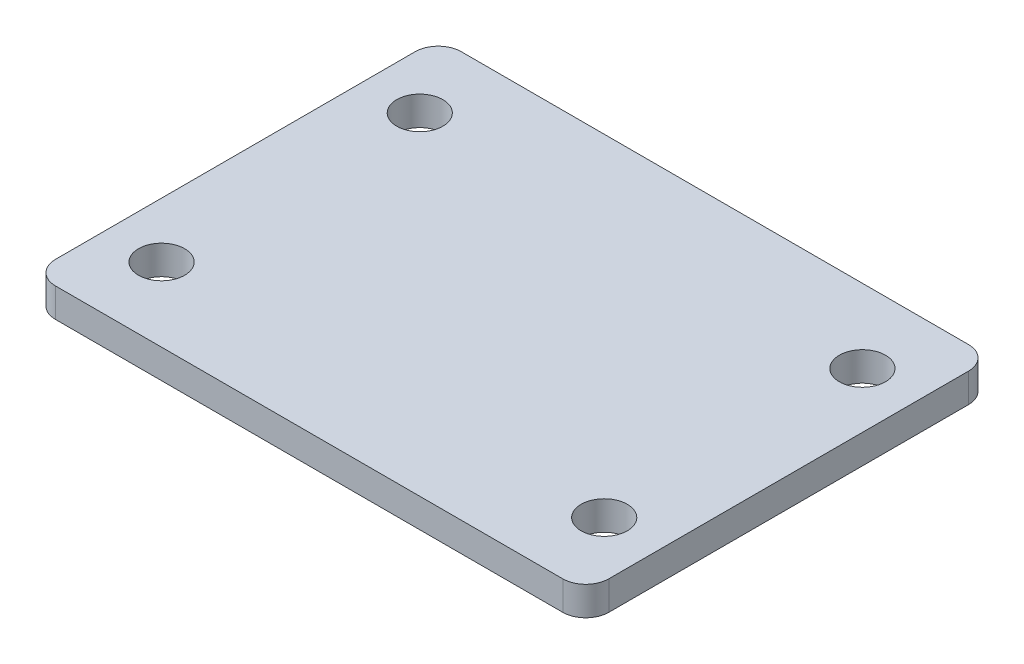
ISO-10303-21;
HEADER;
FILE_DESCRIPTION(('STEP AP214'),'2;1');
FILE_NAME('part.step','',(''),(''),'','','');
FILE_SCHEMA(('AUTOMOTIVE_DESIGN { 1 0 10303 214 1 1 1 1 }'));
ENDSEC;
DATA;
#1=APPLICATION_CONTEXT('core data for automotive mechanical design processes');
#2=APPLICATION_PROTOCOL_DEFINITION('international standard','automotive_design',2000,#1);
#3=PRODUCT_CONTEXT('',#1,'mechanical');
#4=PRODUCT('Part','Part','',(#3));
#5=PRODUCT_RELATED_PRODUCT_CATEGORY('part','',(#4));
#6=PRODUCT_DEFINITION_FORMATION('','',#4);
#7=PRODUCT_DEFINITION_CONTEXT('part definition',#1,'design');
#8=PRODUCT_DEFINITION('design','',#6,#7);
#9=PRODUCT_DEFINITION_SHAPE('','',#8);
#10=(LENGTH_UNIT() NAMED_UNIT(*) SI_UNIT(.MILLI.,.METRE.));
#11=(NAMED_UNIT(*) PLANE_ANGLE_UNIT() SI_UNIT($,.RADIAN.));
#12=(NAMED_UNIT(*) SI_UNIT($,.STERADIAN.) SOLID_ANGLE_UNIT());
#13=UNCERTAINTY_MEASURE_WITH_UNIT(LENGTH_MEASURE(1.E-05),#10,'distance_accuracy_value','');
#14=(GEOMETRIC_REPRESENTATION_CONTEXT(3) GLOBAL_UNCERTAINTY_ASSIGNED_CONTEXT((#13)) GLOBAL_UNIT_ASSIGNED_CONTEXT((#10,
#11,#12)) REPRESENTATION_CONTEXT('',''));
#15=CARTESIAN_POINT('',(0.,0.,0.));
#16=DIRECTION('',(0.,0.,1.));
#17=DIRECTION('',(1.,0.,0.));
#18=AXIS2_PLACEMENT_3D('',#15,#16,#17);
#19=CARTESIAN_POINT('',(-43.6626,5.,30.9626));
#20=DIRECTION('',(0.,1.,0.));
#21=DIRECTION('',(0.,0.,1.));
#22=AXIS2_PLACEMENT_3D('',#19,#20,#21);
#23=PLANE('',#22);
#24=CARTESIAN_POINT('',(38.1,5.,22.225));
#25=DIRECTION('',(0.,1.,0.));
#26=DIRECTION('',(0.,0.,1.));
#27=AXIS2_PLACEMENT_3D('',#24,#25,#26);
#28=CIRCLE('',#27,3.96875);
#29=CARTESIAN_POINT('',(38.1,5.,26.19375));
#30=VERTEX_POINT('',#29);
#31=EDGE_CURVE('E221',#30,#30,#28,.T.);
#32=ORIENTED_EDGE('',*,*,#31,.F.);
#33=EDGE_LOOP('',(#32));
#34=FACE_BOUND('',#33,.T.);
#35=CARTESIAN_POINT('',(-38.1,5.,-22.225));
#36=DIRECTION('',(0.,1.,0.));
#37=DIRECTION('',(0.,0.,1.));
#38=AXIS2_PLACEMENT_3D('',#35,#36,#37);
#39=CIRCLE('',#38,3.96875);
#40=CARTESIAN_POINT('',(-38.1,5.,-18.25625));
#41=VERTEX_POINT('',#40);
#42=EDGE_CURVE('E146',#41,#41,#39,.T.);
#43=ORIENTED_EDGE('',*,*,#42,.F.);
#44=EDGE_LOOP('',(#43));
#45=FACE_BOUND('',#44,.T.);
#46=CARTESIAN_POINT('',(-43.6626,5.,30.9626));
#47=DIRECTION('',(0.,1.,0.));
#48=DIRECTION('',(0.,0.,1.));
#49=AXIS2_PLACEMENT_3D('',#46,#47,#48);
#50=CIRCLE('',#49,3.9624);
#51=CARTESIAN_POINT('',(-47.625,5.,30.9626));
#52=VERTEX_POINT('',#51);
#53=CARTESIAN_POINT('',(-43.6626,5.,34.925));
#54=VERTEX_POINT('',#53);
#55=EDGE_CURVE('E164',#52,#54,#50,.T.);
#56=ORIENTED_EDGE('',*,*,#55,.T.);
#57=DIRECTION('',(1.,0.,0.));
#58=VECTOR('',#57,1.);
#59=CARTESIAN_POINT('',(-43.6626,5.,34.925));
#60=LINE('',#59,#58);
#61=CARTESIAN_POINT('',(43.6626,5.,34.925));
#62=VERTEX_POINT('',#61);
#63=EDGE_CURVE('E100',#54,#62,#60,.T.);
#64=ORIENTED_EDGE('',*,*,#63,.T.);
#65=CARTESIAN_POINT('',(43.6626,5.,30.9626));
#66=DIRECTION('',(0.,1.,0.));
#67=DIRECTION('',(0.,0.,1.));
#68=AXIS2_PLACEMENT_3D('',#65,#66,#67);
#69=CIRCLE('',#68,3.9624);
#70=CARTESIAN_POINT('',(47.625,5.,30.9626));
#71=VERTEX_POINT('',#70);
#72=EDGE_CURVE('E185',#62,#71,#69,.T.);
#73=ORIENTED_EDGE('',*,*,#72,.T.);
#74=DIRECTION('',(0.,0.,-1.));
#75=VECTOR('',#74,1.);
#76=CARTESIAN_POINT('',(47.625,5.,-30.9626));
#77=LINE('',#76,#75);
#78=CARTESIAN_POINT('',(47.625,5.,-30.9626));
#79=VERTEX_POINT('',#78);
#80=EDGE_CURVE('E199',#71,#79,#77,.T.);
#81=ORIENTED_EDGE('',*,*,#80,.T.);
#82=CARTESIAN_POINT('',(43.6626,5.,-30.9626));
#83=DIRECTION('',(0.,1.,0.));
#84=DIRECTION('',(0.,0.,-1.));
#85=AXIS2_PLACEMENT_3D('',#82,#83,#84);
#86=CIRCLE('',#85,3.9624);
#87=CARTESIAN_POINT('',(43.6626,5.,-34.925));
#88=VERTEX_POINT('',#87);
#89=EDGE_CURVE('E119',#79,#88,#86,.T.);
#90=ORIENTED_EDGE('',*,*,#89,.T.);
#91=DIRECTION('',(-1.,0.,0.));
#92=VECTOR('',#91,1.);
#93=CARTESIAN_POINT('',(-43.6626,5.,-34.925));
#94=LINE('',#93,#92);
#95=CARTESIAN_POINT('',(-43.6626,5.,-34.925));
#96=VERTEX_POINT('',#95);
#97=EDGE_CURVE('E113',#88,#96,#94,.T.);
#98=ORIENTED_EDGE('',*,*,#97,.T.);
#99=CARTESIAN_POINT('',(-43.6626,5.,-30.9626));
#100=DIRECTION('',(0.,1.,0.));
#101=DIRECTION('',(0.,0.,1.));
#102=AXIS2_PLACEMENT_3D('',#99,#100,#101);
#103=CIRCLE('',#102,3.9624);
#104=CARTESIAN_POINT('',(-47.625,5.,-30.9626));
#105=VERTEX_POINT('',#104);
#106=EDGE_CURVE('E117',#96,#105,#103,.T.);
#107=ORIENTED_EDGE('',*,*,#106,.T.);
#108=DIRECTION('',(0.,0.,1.));
#109=VECTOR('',#108,1.);
#110=CARTESIAN_POINT('',(-47.625,5.,-30.9626));
#111=LINE('',#110,#109);
#112=EDGE_CURVE('E57',#105,#52,#111,.T.);
#113=ORIENTED_EDGE('',*,*,#112,.T.);
#114=EDGE_LOOP('',(#56,#64,#73,#81,#90,#98,#107,#113));
#115=FACE_BOUND('',#114,.T.);
#116=CARTESIAN_POINT('',(-38.1,5.,22.225));
#117=DIRECTION('',(0.,1.,0.));
#118=DIRECTION('',(0.,0.,-1.));
#119=AXIS2_PLACEMENT_3D('',#116,#117,#118);
#120=CIRCLE('',#119,3.96875);
#121=CARTESIAN_POINT('',(-38.1,5.,18.25625));
#122=VERTEX_POINT('',#121);
#123=EDGE_CURVE('E213',#122,#122,#120,.T.);
#124=ORIENTED_EDGE('',*,*,#123,.F.);
#125=EDGE_LOOP('',(#124));
#126=FACE_BOUND('',#125,.T.);
#127=CARTESIAN_POINT('',(38.1,5.,-22.225));
#128=DIRECTION('',(0.,1.,0.));
#129=DIRECTION('',(0.,0.,-1.));
#130=AXIS2_PLACEMENT_3D('',#127,#128,#129);
#131=CIRCLE('',#130,3.96875);
#132=CARTESIAN_POINT('',(38.1,5.,-26.19375));
#133=VERTEX_POINT('',#132);
#134=EDGE_CURVE('E229',#133,#133,#131,.T.);
#135=ORIENTED_EDGE('',*,*,#134,.F.);
#136=EDGE_LOOP('',(#135));
#137=FACE_BOUND('',#136,.T.);
#138=ADVANCED_FACE('F39',(#34,#45,#115,#126,#137),#23,.T.);
#139=CARTESIAN_POINT('',(-43.6626,0.,30.9626));
#140=DIRECTION('',(0.,1.,0.));
#141=DIRECTION('',(0.,0.,1.));
#142=AXIS2_PLACEMENT_3D('',#139,#140,#141);
#143=PLANE('',#142);
#144=CARTESIAN_POINT('',(-43.6626,0.,30.9626));
#145=DIRECTION('',(0.,1.,0.));
#146=DIRECTION('',(0.,0.,1.));
#147=AXIS2_PLACEMENT_3D('',#144,#145,#146);
#148=CIRCLE('',#147,3.9624);
#149=CARTESIAN_POINT('',(-47.625,0.,30.9626));
#150=VERTEX_POINT('',#149);
#151=CARTESIAN_POINT('',(-43.6626,0.,34.925));
#152=VERTEX_POINT('',#151);
#153=EDGE_CURVE('E141',#150,#152,#148,.T.);
#154=ORIENTED_EDGE('',*,*,#153,.F.);
#155=DIRECTION('',(0.,0.,1.));
#156=VECTOR('',#155,1.);
#157=CARTESIAN_POINT('',(-47.625,0.,-30.9626));
#158=LINE('',#157,#156);
#159=CARTESIAN_POINT('',(-47.625,0.,-30.9626));
#160=VERTEX_POINT('',#159);
#161=EDGE_CURVE('E92',#160,#150,#158,.T.);
#162=ORIENTED_EDGE('',*,*,#161,.F.);
#163=CARTESIAN_POINT('',(-43.6626,0.,-30.9626));
#164=DIRECTION('',(0.,1.,0.));
#165=DIRECTION('',(0.,0.,1.));
#166=AXIS2_PLACEMENT_3D('',#163,#164,#165);
#167=CIRCLE('',#166,3.9624);
#168=CARTESIAN_POINT('',(-43.6626,0.,-34.925));
#169=VERTEX_POINT('',#168);
#170=EDGE_CURVE('E86',#169,#160,#167,.T.);
#171=ORIENTED_EDGE('',*,*,#170,.F.);
#172=DIRECTION('',(-1.,0.,0.));
#173=VECTOR('',#172,1.);
#174=CARTESIAN_POINT('',(-43.6626,0.,-34.925));
#175=LINE('',#174,#173);
#176=CARTESIAN_POINT('',(43.6626,0.,-34.925));
#177=VERTEX_POINT('',#176);
#178=EDGE_CURVE('E128',#177,#169,#175,.T.);
#179=ORIENTED_EDGE('',*,*,#178,.F.);
#180=CARTESIAN_POINT('',(43.6626,0.,-30.9626));
#181=DIRECTION('',(0.,1.,0.));
#182=DIRECTION('',(0.,0.,-1.));
#183=AXIS2_PLACEMENT_3D('',#180,#181,#182);
#184=CIRCLE('',#183,3.9624);
#185=CARTESIAN_POINT('',(47.625,0.,-30.9626));
#186=VERTEX_POINT('',#185);
#187=EDGE_CURVE('E155',#186,#177,#184,.T.);
#188=ORIENTED_EDGE('',*,*,#187,.F.);
#189=DIRECTION('',(0.,0.,-1.));
#190=VECTOR('',#189,1.);
#191=CARTESIAN_POINT('',(47.625,0.,-30.9626));
#192=LINE('',#191,#190);
#193=CARTESIAN_POINT('',(47.625,0.,30.9626));
#194=VERTEX_POINT('',#193);
#195=EDGE_CURVE('E152',#194,#186,#192,.T.);
#196=ORIENTED_EDGE('',*,*,#195,.F.);
#197=CARTESIAN_POINT('',(43.6626,0.,30.9626));
#198=DIRECTION('',(0.,1.,0.));
#199=DIRECTION('',(0.,0.,1.));
#200=AXIS2_PLACEMENT_3D('',#197,#198,#199);
#201=CIRCLE('',#200,3.9624);
#202=CARTESIAN_POINT('',(43.6626,0.,34.925));
#203=VERTEX_POINT('',#202);
#204=EDGE_CURVE('E149',#203,#194,#201,.T.);
#205=ORIENTED_EDGE('',*,*,#204,.F.);
#206=DIRECTION('',(1.,0.,0.));
#207=VECTOR('',#206,1.);
#208=CARTESIAN_POINT('',(-43.6626,0.,34.925));
#209=LINE('',#208,#207);
#210=EDGE_CURVE('E145',#152,#203,#209,.T.);
#211=ORIENTED_EDGE('',*,*,#210,.F.);
#212=EDGE_LOOP('',(#154,#162,#171,#179,#188,#196,#205,#211));
#213=FACE_BOUND('',#212,.T.);
#214=CARTESIAN_POINT('',(-38.1,0.,-22.225));
#215=DIRECTION('',(0.,1.,0.));
#216=DIRECTION('',(0.,0.,1.));
#217=AXIS2_PLACEMENT_3D('',#214,#215,#216);
#218=CIRCLE('',#217,3.96875);
#219=CARTESIAN_POINT('',(-38.1,0.,-18.25625));
#220=VERTEX_POINT('',#219);
#221=EDGE_CURVE('E209',#220,#220,#218,.T.);
#222=ORIENTED_EDGE('',*,*,#221,.T.);
#223=EDGE_LOOP('',(#222));
#224=FACE_BOUND('',#223,.T.);
#225=CARTESIAN_POINT('',(-38.1,0.,22.225));
#226=DIRECTION('',(0.,1.,0.));
#227=DIRECTION('',(0.,0.,-1.));
#228=AXIS2_PLACEMENT_3D('',#225,#226,#227);
#229=CIRCLE('',#228,3.96875);
#230=CARTESIAN_POINT('',(-38.1,0.,18.25625));
#231=VERTEX_POINT('',#230);
#232=EDGE_CURVE('E217',#231,#231,#229,.T.);
#233=ORIENTED_EDGE('',*,*,#232,.T.);
#234=EDGE_LOOP('',(#233));
#235=FACE_BOUND('',#234,.T.);
#236=CARTESIAN_POINT('',(38.1,0.,22.225));
#237=DIRECTION('',(0.,1.,0.));
#238=DIRECTION('',(0.,0.,1.));
#239=AXIS2_PLACEMENT_3D('',#236,#237,#238);
#240=CIRCLE('',#239,3.96875);
#241=CARTESIAN_POINT('',(38.1,0.,26.19375));
#242=VERTEX_POINT('',#241);
#243=EDGE_CURVE('E225',#242,#242,#240,.T.);
#244=ORIENTED_EDGE('',*,*,#243,.T.);
#245=EDGE_LOOP('',(#244));
#246=FACE_BOUND('',#245,.T.);
#247=CARTESIAN_POINT('',(38.1,0.,-22.225));
#248=DIRECTION('',(0.,1.,0.));
#249=DIRECTION('',(0.,0.,-1.));
#250=AXIS2_PLACEMENT_3D('',#247,#248,#249);
#251=CIRCLE('',#250,3.96875);
#252=CARTESIAN_POINT('',(38.1,0.,-26.19375));
#253=VERTEX_POINT('',#252);
#254=EDGE_CURVE('E233',#253,#253,#251,.T.);
#255=ORIENTED_EDGE('',*,*,#254,.T.);
#256=EDGE_LOOP('',(#255));
#257=FACE_BOUND('',#256,.T.);
#258=ADVANCED_FACE('F189',(#213,#224,#235,#246,#257),#143,.F.);
#259=CARTESIAN_POINT('',(-43.6626,5.,30.9626));
#260=DIRECTION('',(0.,-1.,0.));
#261=DIRECTION('',(0.,0.,-1.));
#262=AXIS2_PLACEMENT_3D('',#259,#260,#261);
#263=CYLINDRICAL_SURFACE('',#262,3.9624);
#264=ORIENTED_EDGE('',*,*,#153,.T.);
#265=DIRECTION('',(0.,-1.,0.));
#266=VECTOR('',#265,1.);
#267=CARTESIAN_POINT('',(-43.6626,5.,34.925));
#268=LINE('',#267,#266);
#269=EDGE_CURVE('E11',#54,#152,#268,.T.);
#270=ORIENTED_EDGE('',*,*,#269,.F.);
#271=ORIENTED_EDGE('',*,*,#55,.F.);
#272=DIRECTION('',(0.,-1.,0.));
#273=VECTOR('',#272,1.);
#274=CARTESIAN_POINT('',(-47.625,5.,30.9626));
#275=LINE('',#274,#273);
#276=EDGE_CURVE('E137',#52,#150,#275,.T.);
#277=ORIENTED_EDGE('',*,*,#276,.T.);
#278=EDGE_LOOP('',(#264,#270,#271,#277));
#279=FACE_BOUND('',#278,.T.);
#280=ADVANCED_FACE('F41',(#279),#263,.T.);
#281=CARTESIAN_POINT('',(-43.6626,5.,34.925));
#282=DIRECTION('',(0.,0.,-1.));
#283=DIRECTION('',(-1.,0.,0.));
#284=AXIS2_PLACEMENT_3D('',#281,#282,#283);
#285=PLANE('',#284);
#286=ORIENTED_EDGE('',*,*,#210,.T.);
#287=DIRECTION('',(0.,-1.,0.));
#288=VECTOR('',#287,1.);
#289=CARTESIAN_POINT('',(43.6626,5.,34.925));
#290=LINE('',#289,#288);
#291=EDGE_CURVE('E49',#62,#203,#290,.T.);
#292=ORIENTED_EDGE('',*,*,#291,.F.);
#293=ORIENTED_EDGE('',*,*,#63,.F.);
#294=ORIENTED_EDGE('',*,*,#269,.T.);
#295=EDGE_LOOP('',(#286,#292,#293,#294));
#296=FACE_BOUND('',#295,.T.);
#297=ADVANCED_FACE('F269',(#296),#285,.F.);
#298=CARTESIAN_POINT('',(43.6626,5.,30.9626));
#299=DIRECTION('',(0.,-1.,0.));
#300=DIRECTION('',(0.,0.,-1.));
#301=AXIS2_PLACEMENT_3D('',#298,#299,#300);
#302=CYLINDRICAL_SURFACE('',#301,3.9624);
#303=ORIENTED_EDGE('',*,*,#204,.T.);
#304=DIRECTION('',(0.,-1.,0.));
#305=VECTOR('',#304,1.);
#306=CARTESIAN_POINT('',(47.625,5.,30.9626));
#307=LINE('',#306,#305);
#308=EDGE_CURVE('E175',#71,#194,#307,.T.);
#309=ORIENTED_EDGE('',*,*,#308,.F.);
#310=ORIENTED_EDGE('',*,*,#72,.F.);
#311=ORIENTED_EDGE('',*,*,#291,.T.);
#312=EDGE_LOOP('',(#303,#309,#310,#311));
#313=FACE_BOUND('',#312,.T.);
#314=ADVANCED_FACE('F183',(#313),#302,.T.);
#315=CARTESIAN_POINT('',(47.625,5.,-30.9626));
#316=DIRECTION('',(-1.,0.,0.));
#317=DIRECTION('',(0.,0.,1.));
#318=AXIS2_PLACEMENT_3D('',#315,#316,#317);
#319=PLANE('',#318);
#320=ORIENTED_EDGE('',*,*,#195,.T.);
#321=DIRECTION('',(0.,-1.,0.));
#322=VECTOR('',#321,1.);
#323=CARTESIAN_POINT('',(47.625,5.,-30.9626));
#324=LINE('',#323,#322);
#325=EDGE_CURVE('E171',#79,#186,#324,.T.);
#326=ORIENTED_EDGE('',*,*,#325,.F.);
#327=ORIENTED_EDGE('',*,*,#80,.F.);
#328=ORIENTED_EDGE('',*,*,#308,.T.);
#329=EDGE_LOOP('',(#320,#326,#327,#328));
#330=FACE_BOUND('',#329,.T.);
#331=ADVANCED_FACE('F194',(#330),#319,.F.);
#332=CARTESIAN_POINT('',(43.6626,5.,-30.9626));
#333=DIRECTION('',(0.,-1.,0.));
#334=DIRECTION('',(0.,0.,-1.));
#335=AXIS2_PLACEMENT_3D('',#332,#333,#334);
#336=CYLINDRICAL_SURFACE('',#335,3.9624);
#337=ORIENTED_EDGE('',*,*,#187,.T.);
#338=DIRECTION('',(0.,-1.,0.));
#339=VECTOR('',#338,1.);
#340=CARTESIAN_POINT('',(43.6626,5.,-34.925));
#341=LINE('',#340,#339);
#342=EDGE_CURVE('E130',#88,#177,#341,.T.);
#343=ORIENTED_EDGE('',*,*,#342,.F.);
#344=ORIENTED_EDGE('',*,*,#89,.F.);
#345=ORIENTED_EDGE('',*,*,#325,.T.);
#346=EDGE_LOOP('',(#337,#343,#344,#345));
#347=FACE_BOUND('',#346,.T.);
#348=ADVANCED_FACE('F197',(#347),#336,.T.);
#349=CARTESIAN_POINT('',(-43.6626,5.,-34.925));
#350=DIRECTION('',(0.,0.,1.));
#351=DIRECTION('',(1.,0.,0.));
#352=AXIS2_PLACEMENT_3D('',#349,#350,#351);
#353=PLANE('',#352);
#354=ORIENTED_EDGE('',*,*,#178,.T.);
#355=DIRECTION('',(0.,-1.,0.));
#356=VECTOR('',#355,1.);
#357=CARTESIAN_POINT('',(-43.6626,5.,-34.925));
#358=LINE('',#357,#356);
#359=EDGE_CURVE('E125',#96,#169,#358,.T.);
#360=ORIENTED_EDGE('',*,*,#359,.F.);
#361=ORIENTED_EDGE('',*,*,#97,.F.);
#362=ORIENTED_EDGE('',*,*,#342,.T.);
#363=EDGE_LOOP('',(#354,#360,#361,#362));
#364=FACE_BOUND('',#363,.T.);
#365=ADVANCED_FACE('F126',(#364),#353,.F.);
#366=CARTESIAN_POINT('',(-43.6626,5.,-30.9626));
#367=DIRECTION('',(0.,-1.,0.));
#368=DIRECTION('',(0.,0.,-1.));
#369=AXIS2_PLACEMENT_3D('',#366,#367,#368);
#370=CYLINDRICAL_SURFACE('',#369,3.9624);
#371=ORIENTED_EDGE('',*,*,#170,.T.);
#372=DIRECTION('',(0.,-1.,0.));
#373=VECTOR('',#372,1.);
#374=CARTESIAN_POINT('',(-47.625,5.,-30.9626));
#375=LINE('',#374,#373);
#376=EDGE_CURVE('E131',#105,#160,#375,.T.);
#377=ORIENTED_EDGE('',*,*,#376,.F.);
#378=ORIENTED_EDGE('',*,*,#106,.F.);
#379=ORIENTED_EDGE('',*,*,#359,.T.);
#380=EDGE_LOOP('',(#371,#377,#378,#379));
#381=FACE_BOUND('',#380,.T.);
#382=ADVANCED_FACE('F133',(#381),#370,.T.);
#383=CARTESIAN_POINT('',(-47.625,5.,-30.9626));
#384=DIRECTION('',(1.,0.,0.));
#385=DIRECTION('',(0.,0.,-1.));
#386=AXIS2_PLACEMENT_3D('',#383,#384,#385);
#387=PLANE('',#386);
#388=ORIENTED_EDGE('',*,*,#161,.T.);
#389=ORIENTED_EDGE('',*,*,#276,.F.);
#390=ORIENTED_EDGE('',*,*,#112,.F.);
#391=ORIENTED_EDGE('',*,*,#376,.T.);
#392=EDGE_LOOP('',(#388,#389,#390,#391));
#393=FACE_BOUND('',#392,.T.);
#394=ADVANCED_FACE('F257',(#393),#387,.F.);
#395=CARTESIAN_POINT('',(-38.1,5.,-22.225));
#396=DIRECTION('',(0.,-1.,0.));
#397=DIRECTION('',(0.,0.,-1.));
#398=AXIS2_PLACEMENT_3D('',#395,#396,#397);
#399=CYLINDRICAL_SURFACE('',#398,3.96875);
#400=ORIENTED_EDGE('',*,*,#42,.T.);
#401=EDGE_LOOP('',(#400));
#402=FACE_BOUND('',#401,.T.);
#403=ORIENTED_EDGE('',*,*,#221,.F.);
#404=EDGE_LOOP('',(#403));
#405=FACE_BOUND('',#404,.T.);
#406=ADVANCED_FACE('F254',(#402,#405),#399,.F.);
#407=CARTESIAN_POINT('',(-38.1,5.,22.225));
#408=DIRECTION('',(0.,-1.,0.));
#409=DIRECTION('',(0.,0.,-1.));
#410=AXIS2_PLACEMENT_3D('',#407,#408,#409);
#411=CYLINDRICAL_SURFACE('',#410,3.96875);
#412=ORIENTED_EDGE('',*,*,#123,.T.);
#413=EDGE_LOOP('',(#412));
#414=FACE_BOUND('',#413,.T.);
#415=ORIENTED_EDGE('',*,*,#232,.F.);
#416=EDGE_LOOP('',(#415));
#417=FACE_BOUND('',#416,.T.);
#418=ADVANCED_FACE('F333',(#414,#417),#411,.F.);
#419=CARTESIAN_POINT('',(38.1,5.,22.225));
#420=DIRECTION('',(0.,-1.,0.));
#421=DIRECTION('',(0.,0.,-1.));
#422=AXIS2_PLACEMENT_3D('',#419,#420,#421);
#423=CYLINDRICAL_SURFACE('',#422,3.96875);
#424=ORIENTED_EDGE('',*,*,#31,.T.);
#425=EDGE_LOOP('',(#424));
#426=FACE_BOUND('',#425,.T.);
#427=ORIENTED_EDGE('',*,*,#243,.F.);
#428=EDGE_LOOP('',(#427));
#429=FACE_BOUND('',#428,.T.);
#430=ADVANCED_FACE('F341',(#426,#429),#423,.F.);
#431=CARTESIAN_POINT('',(38.1,5.,-22.225));
#432=DIRECTION('',(0.,-1.,0.));
#433=DIRECTION('',(0.,0.,-1.));
#434=AXIS2_PLACEMENT_3D('',#431,#432,#433);
#435=CYLINDRICAL_SURFACE('',#434,3.96875);
#436=ORIENTED_EDGE('',*,*,#134,.T.);
#437=EDGE_LOOP('',(#436));
#438=FACE_BOUND('',#437,.T.);
#439=ORIENTED_EDGE('',*,*,#254,.F.);
#440=EDGE_LOOP('',(#439));
#441=FACE_BOUND('',#440,.T.);
#442=ADVANCED_FACE('F241',(#438,#441),#435,.F.);
#443=CLOSED_SHELL('',(#138,#258,#280,#297,#314,#331,#348,#365,#382,#394,#406,#418,#430,#442));
#444=MANIFOLD_SOLID_BREP('B2',#443);
#445=ADVANCED_BREP_SHAPE_REPRESENTATION('',(#18,#444),#14);
#446=SHAPE_DEFINITION_REPRESENTATION(#9,#445);
ENDSEC;
END-ISO-10303-21;
